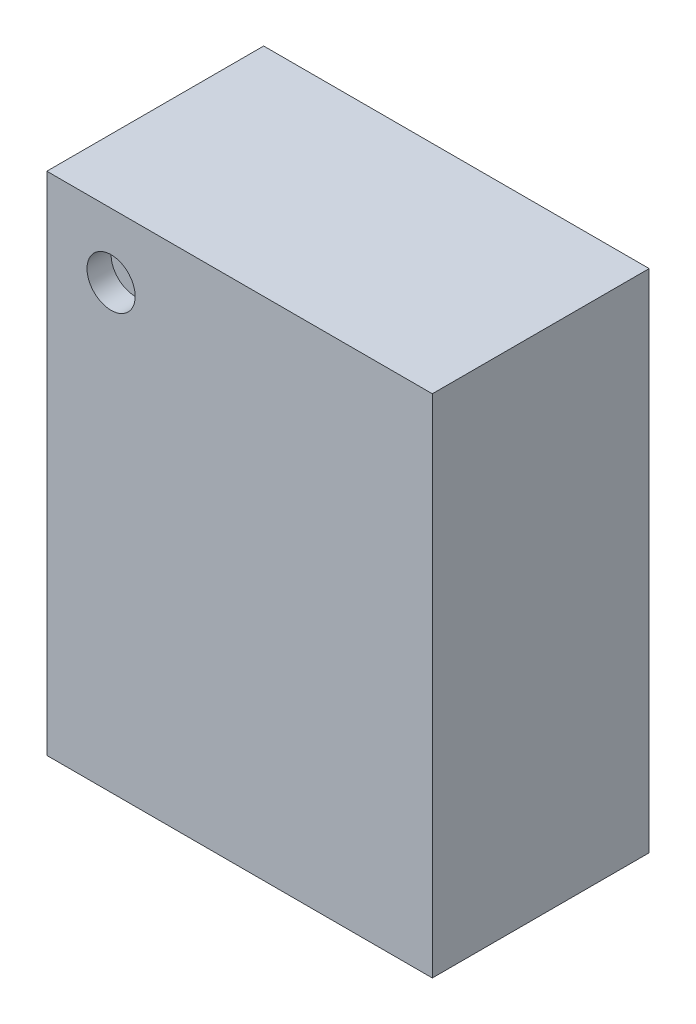
ISO-10303-21;
HEADER;
FILE_DESCRIPTION(('STEP AP214'),'2;1');
FILE_NAME('part.step','',(''),(''),'','','');
FILE_SCHEMA(('AUTOMOTIVE_DESIGN { 1 0 10303 214 1 1 1 1 }'));
ENDSEC;
DATA;
#1=APPLICATION_CONTEXT('core data for automotive mechanical design processes');
#2=APPLICATION_PROTOCOL_DEFINITION('international standard','automotive_design',2000,#1);
#3=PRODUCT_CONTEXT('',#1,'mechanical');
#4=PRODUCT('Part','Part','',(#3));
#5=PRODUCT_RELATED_PRODUCT_CATEGORY('part','',(#4));
#6=PRODUCT_DEFINITION_FORMATION('','',#4);
#7=PRODUCT_DEFINITION_CONTEXT('part definition',#1,'design');
#8=PRODUCT_DEFINITION('design','',#6,#7);
#9=PRODUCT_DEFINITION_SHAPE('','',#8);
#10=(LENGTH_UNIT() NAMED_UNIT(*) SI_UNIT(.MILLI.,.METRE.));
#11=(NAMED_UNIT(*) PLANE_ANGLE_UNIT() SI_UNIT($,.RADIAN.));
#12=(NAMED_UNIT(*) SI_UNIT($,.STERADIAN.) SOLID_ANGLE_UNIT());
#13=UNCERTAINTY_MEASURE_WITH_UNIT(LENGTH_MEASURE(1.E-05),#10,'distance_accuracy_value','');
#14=(GEOMETRIC_REPRESENTATION_CONTEXT(3) GLOBAL_UNCERTAINTY_ASSIGNED_CONTEXT((#13)) GLOBAL_UNIT_ASSIGNED_CONTEXT((#10,
#11,#12)) REPRESENTATION_CONTEXT('',''));
#15=CARTESIAN_POINT('',(0.,0.,0.));
#16=DIRECTION('',(0.,0.,1.));
#17=DIRECTION('',(1.,0.,0.));
#18=AXIS2_PLACEMENT_3D('',#15,#16,#17);
#19=CARTESIAN_POINT('',(0.266666666667,1.833333333333,0.8));
#20=DIRECTION('',(0.,0.,1.));
#21=DIRECTION('',(1.,0.,0.));
#22=AXIS2_PLACEMENT_3D('',#19,#20,#21);
#23=PLANE('',#22);
#24=CARTESIAN_POINT('',(0.266666666667,1.833333333333,0.8));
#25=DIRECTION('',(0.,0.,1.));
#26=DIRECTION('',(1.,0.,0.));
#27=AXIS2_PLACEMENT_3D('',#24,#25,#26);
#28=CIRCLE('',#27,0.1);
#29=CARTESIAN_POINT('',(0.366666666667,1.833333333333,0.8));
#30=VERTEX_POINT('',#29);
#31=EDGE_CURVE('E26',#30,#30,#28,.T.);
#32=ORIENTED_EDGE('',*,*,#31,.T.);
#33=EDGE_LOOP('',(#32));
#34=FACE_BOUND('',#33,.T.);
#35=ADVANCED_FACE('F17',(#34),#23,.T.);
#36=CARTESIAN_POINT('',(0.266666666667,1.833333333333,0.8));
#37=DIRECTION('',(0.,0.,1.));
#38=DIRECTION('',(1.,0.,0.));
#39=AXIS2_PLACEMENT_3D('',#36,#37,#38);
#40=CYLINDRICAL_SURFACE('',#39,0.1);
#41=ORIENTED_EDGE('',*,*,#31,.F.);
#42=DIRECTION('',(0.,0.,1.));
#43=VECTOR('',#42,1.);
#44=CARTESIAN_POINT('',(0.366666666667,1.833333333333,0.8));
#45=LINE('',#44,#43);
#46=CARTESIAN_POINT('',(0.366666666667,1.833333333333,0.9));
#47=VERTEX_POINT('',#46);
#48=EDGE_CURVE('E11',#30,#47,#45,.T.);
#49=ORIENTED_EDGE('',*,*,#48,.T.);
#50=CARTESIAN_POINT('',(0.266666666667,1.833333333333,0.9));
#51=DIRECTION('',(0.,0.,1.));
#52=DIRECTION('',(1.,0.,0.));
#53=AXIS2_PLACEMENT_3D('',#50,#51,#52);
#54=CIRCLE('',#53,0.1);
#55=EDGE_CURVE('E93',#47,#47,#54,.T.);
#56=ORIENTED_EDGE('',*,*,#55,.T.);
#57=ORIENTED_EDGE('',*,*,#48,.F.);
#58=EDGE_LOOP('',(#41,#49,#56,#57));
#59=FACE_BOUND('',#58,.T.);
#60=ADVANCED_FACE('F19',(#59),#40,.F.);
#61=CARTESIAN_POINT('',(1.6,0.,0.));
#62=DIRECTION('',(1.,0.,0.));
#63=DIRECTION('',(0.,1.,0.));
#64=AXIS2_PLACEMENT_3D('',#61,#62,#63);
#65=PLANE('',#64);
#66=DIRECTION('',(0.,0.,1.));
#67=VECTOR('',#66,1.);
#68=CARTESIAN_POINT('',(1.6,0.,0.));
#69=LINE('',#68,#67);
#70=CARTESIAN_POINT('',(1.6,0.,0.));
#71=VERTEX_POINT('',#70);
#72=CARTESIAN_POINT('',(1.6,0.,0.9));
#73=VERTEX_POINT('',#72);
#74=EDGE_CURVE('E122',#71,#73,#69,.T.);
#75=ORIENTED_EDGE('',*,*,#74,.F.);
#76=DIRECTION('',(0.,1.,0.));
#77=VECTOR('',#76,1.);
#78=CARTESIAN_POINT('',(1.6,0.,0.));
#79=LINE('',#78,#77);
#80=CARTESIAN_POINT('',(1.6,2.1,0.));
#81=VERTEX_POINT('',#80);
#82=EDGE_CURVE('E49',#71,#81,#79,.T.);
#83=ORIENTED_EDGE('',*,*,#82,.T.);
#84=DIRECTION('',(0.,0.,1.));
#85=VECTOR('',#84,1.);
#86=CARTESIAN_POINT('',(1.6,2.1,0.));
#87=LINE('',#86,#85);
#88=CARTESIAN_POINT('',(1.6,2.1,0.9));
#89=VERTEX_POINT('',#88);
#90=EDGE_CURVE('E72',#81,#89,#87,.T.);
#91=ORIENTED_EDGE('',*,*,#90,.T.);
#92=DIRECTION('',(0.,1.,0.));
#93=VECTOR('',#92,1.);
#94=CARTESIAN_POINT('',(1.6,0.,0.9));
#95=LINE('',#94,#93);
#96=EDGE_CURVE('E76',#73,#89,#95,.T.);
#97=ORIENTED_EDGE('',*,*,#96,.F.);
#98=EDGE_LOOP('',(#75,#83,#91,#97));
#99=FACE_BOUND('',#98,.T.);
#100=ADVANCED_FACE('F74',(#99),#65,.T.);
#101=CARTESIAN_POINT('',(0.,0.,0.));
#102=DIRECTION('',(0.,0.,1.));
#103=DIRECTION('',(1.,0.,0.));
#104=AXIS2_PLACEMENT_3D('',#101,#102,#103);
#105=PLANE('',#104);
#106=DIRECTION('',(1.,0.,0.));
#107=VECTOR('',#106,1.);
#108=CARTESIAN_POINT('',(0.,2.1,0.));
#109=LINE('',#108,#107);
#110=CARTESIAN_POINT('',(0.,2.1,0.));
#111=VERTEX_POINT('',#110);
#112=EDGE_CURVE('E81',#111,#81,#109,.T.);
#113=ORIENTED_EDGE('',*,*,#112,.T.);
#114=ORIENTED_EDGE('',*,*,#82,.F.);
#115=DIRECTION('',(1.,0.,0.));
#116=VECTOR('',#115,1.);
#117=CARTESIAN_POINT('',(0.,0.,0.));
#118=LINE('',#117,#116);
#119=CARTESIAN_POINT('',(0.,0.,0.));
#120=VERTEX_POINT('',#119);
#121=EDGE_CURVE('E100',#120,#71,#118,.T.);
#122=ORIENTED_EDGE('',*,*,#121,.F.);
#123=DIRECTION('',(0.,1.,0.));
#124=VECTOR('',#123,1.);
#125=CARTESIAN_POINT('',(0.,0.,0.));
#126=LINE('',#125,#124);
#127=EDGE_CURVE('E113',#120,#111,#126,.T.);
#128=ORIENTED_EDGE('',*,*,#127,.T.);
#129=EDGE_LOOP('',(#113,#114,#122,#128));
#130=FACE_BOUND('',#129,.T.);
#131=ADVANCED_FACE('F150',(#130),#105,.F.);
#132=CARTESIAN_POINT('',(0.,2.1,0.));
#133=DIRECTION('',(0.,1.,0.));
#134=DIRECTION('',(1.,0.,0.));
#135=AXIS2_PLACEMENT_3D('',#132,#133,#134);
#136=PLANE('',#135);
#137=ORIENTED_EDGE('',*,*,#112,.F.);
#138=DIRECTION('',(0.,0.,1.));
#139=VECTOR('',#138,1.);
#140=CARTESIAN_POINT('',(0.,2.1,0.));
#141=LINE('',#140,#139);
#142=CARTESIAN_POINT('',(0.,2.1,0.9));
#143=VERTEX_POINT('',#142);
#144=EDGE_CURVE('E88',#111,#143,#141,.T.);
#145=ORIENTED_EDGE('',*,*,#144,.T.);
#146=DIRECTION('',(1.,0.,0.));
#147=VECTOR('',#146,1.);
#148=CARTESIAN_POINT('',(0.,2.1,0.9));
#149=LINE('',#148,#147);
#150=EDGE_CURVE('E85',#143,#89,#149,.T.);
#151=ORIENTED_EDGE('',*,*,#150,.T.);
#152=ORIENTED_EDGE('',*,*,#90,.F.);
#153=EDGE_LOOP('',(#137,#145,#151,#152));
#154=FACE_BOUND('',#153,.T.);
#155=ADVANCED_FACE('F86',(#154),#136,.T.);
#156=CARTESIAN_POINT('',(0.,0.,0.9));
#157=DIRECTION('',(0.,0.,1.));
#158=DIRECTION('',(1.,0.,0.));
#159=AXIS2_PLACEMENT_3D('',#156,#157,#158);
#160=PLANE('',#159);
#161=ORIENTED_EDGE('',*,*,#55,.F.);
#162=EDGE_LOOP('',(#161));
#163=FACE_BOUND('',#162,.T.);
#164=DIRECTION('',(0.,1.,0.));
#165=VECTOR('',#164,1.);
#166=CARTESIAN_POINT('',(0.,0.,0.9));
#167=LINE('',#166,#165);
#168=CARTESIAN_POINT('',(0.,0.,0.9));
#169=VERTEX_POINT('',#168);
#170=EDGE_CURVE('E109',#169,#143,#167,.T.);
#171=ORIENTED_EDGE('',*,*,#170,.F.);
#172=DIRECTION('',(1.,0.,0.));
#173=VECTOR('',#172,1.);
#174=CARTESIAN_POINT('',(0.,0.,0.9));
#175=LINE('',#174,#173);
#176=EDGE_CURVE('E97',#169,#73,#175,.T.);
#177=ORIENTED_EDGE('',*,*,#176,.T.);
#178=ORIENTED_EDGE('',*,*,#96,.T.);
#179=ORIENTED_EDGE('',*,*,#150,.F.);
#180=EDGE_LOOP('',(#171,#177,#178,#179));
#181=FACE_BOUND('',#180,.T.);
#182=ADVANCED_FACE('F95',(#163,#181),#160,.T.);
#183=CARTESIAN_POINT('',(0.,0.,0.));
#184=DIRECTION('',(0.,1.,0.));
#185=DIRECTION('',(1.,0.,0.));
#186=AXIS2_PLACEMENT_3D('',#183,#184,#185);
#187=PLANE('',#186);
#188=ORIENTED_EDGE('',*,*,#74,.T.);
#189=ORIENTED_EDGE('',*,*,#176,.F.);
#190=DIRECTION('',(0.,0.,1.));
#191=VECTOR('',#190,1.);
#192=CARTESIAN_POINT('',(0.,0.,0.));
#193=LINE('',#192,#191);
#194=EDGE_CURVE('E118',#120,#169,#193,.T.);
#195=ORIENTED_EDGE('',*,*,#194,.F.);
#196=ORIENTED_EDGE('',*,*,#121,.T.);
#197=EDGE_LOOP('',(#188,#189,#195,#196));
#198=FACE_BOUND('',#197,.T.);
#199=ADVANCED_FACE('F139',(#198),#187,.F.);
#200=CARTESIAN_POINT('',(0.,0.,0.));
#201=DIRECTION('',(1.,0.,0.));
#202=DIRECTION('',(0.,1.,0.));
#203=AXIS2_PLACEMENT_3D('',#200,#201,#202);
#204=PLANE('',#203);
#205=ORIENTED_EDGE('',*,*,#170,.T.);
#206=ORIENTED_EDGE('',*,*,#144,.F.);
#207=ORIENTED_EDGE('',*,*,#127,.F.);
#208=ORIENTED_EDGE('',*,*,#194,.T.);
#209=EDGE_LOOP('',(#205,#206,#207,#208));
#210=FACE_BOUND('',#209,.T.);
#211=ADVANCED_FACE('F147',(#210),#204,.F.);
#212=CLOSED_SHELL('',(#35,#60,#100,#131,#155,#182,#199,#211));
#213=MANIFOLD_SOLID_BREP('B1',#212);
#214=ADVANCED_BREP_SHAPE_REPRESENTATION('',(#18,#213),#14);
#215=SHAPE_DEFINITION_REPRESENTATION(#9,#214);
ENDSEC;
END-ISO-10303-21;
